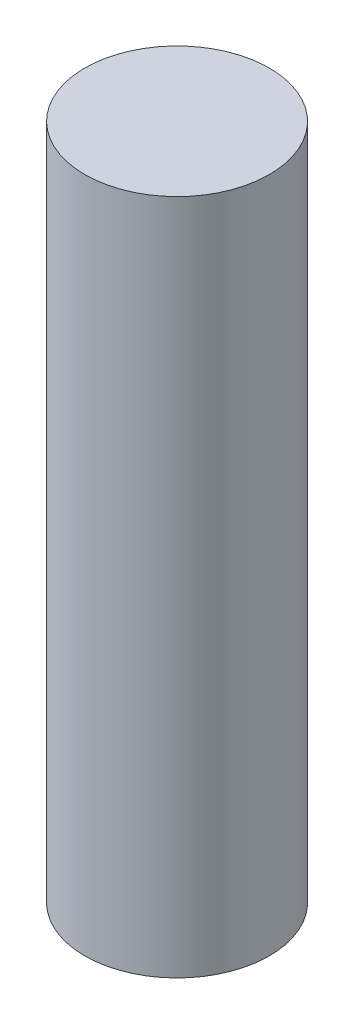
ISO-10303-21;
HEADER;
FILE_DESCRIPTION(('STEP AP214'),'2;1');
FILE_NAME('part.step','',(''),(''),'','','');
FILE_SCHEMA(('AUTOMOTIVE_DESIGN { 1 0 10303 214 1 1 1 1 }'));
ENDSEC;
DATA;
#1=APPLICATION_CONTEXT('core data for automotive mechanical design processes');
#2=APPLICATION_PROTOCOL_DEFINITION('international standard','automotive_design',2000,#1);
#3=PRODUCT_CONTEXT('',#1,'mechanical');
#4=PRODUCT('Part','Part','',(#3));
#5=PRODUCT_RELATED_PRODUCT_CATEGORY('part','',(#4));
#6=PRODUCT_DEFINITION_FORMATION('','',#4);
#7=PRODUCT_DEFINITION_CONTEXT('part definition',#1,'design');
#8=PRODUCT_DEFINITION('design','',#6,#7);
#9=PRODUCT_DEFINITION_SHAPE('','',#8);
#10=(LENGTH_UNIT() NAMED_UNIT(*) SI_UNIT(.MILLI.,.METRE.));
#11=(NAMED_UNIT(*) PLANE_ANGLE_UNIT() SI_UNIT($,.RADIAN.));
#12=(NAMED_UNIT(*) SI_UNIT($,.STERADIAN.) SOLID_ANGLE_UNIT());
#13=UNCERTAINTY_MEASURE_WITH_UNIT(LENGTH_MEASURE(1.E-05),#10,'distance_accuracy_value','');
#14=(GEOMETRIC_REPRESENTATION_CONTEXT(3) GLOBAL_UNCERTAINTY_ASSIGNED_CONTEXT((#13)) GLOBAL_UNIT_ASSIGNED_CONTEXT((#10,
#11,#12)) REPRESENTATION_CONTEXT('',''));
#15=CARTESIAN_POINT('',(0.,0.,0.));
#16=DIRECTION('',(0.,0.,1.));
#17=DIRECTION('',(1.,0.,0.));
#18=AXIS2_PLACEMENT_3D('',#15,#16,#17);
#19=CARTESIAN_POINT('',(0.,11.,0.));
#20=DIRECTION('',(0.,-1.,0.));
#21=DIRECTION('',(0.,0.,-1.));
#22=AXIS2_PLACEMENT_3D('',#19,#20,#21);
#23=CYLINDRICAL_SURFACE('',#22,1.5);
#24=CARTESIAN_POINT('',(0.,11.,0.));
#25=DIRECTION('',(0.,1.,0.));
#26=DIRECTION('',(0.,0.,1.));
#27=AXIS2_PLACEMENT_3D('',#24,#25,#26);
#28=CIRCLE('',#27,1.5);
#29=CARTESIAN_POINT('',(0.,11.,1.5));
#30=VERTEX_POINT('',#29);
#31=EDGE_CURVE('E10',#30,#30,#28,.T.);
#32=ORIENTED_EDGE('',*,*,#31,.F.);
#33=EDGE_LOOP('',(#32));
#34=FACE_BOUND('',#33,.T.);
#35=CARTESIAN_POINT('',(0.,0.,0.));
#36=DIRECTION('',(0.,1.,0.));
#37=DIRECTION('',(0.,0.,1.));
#38=AXIS2_PLACEMENT_3D('',#35,#36,#37);
#39=CIRCLE('',#38,1.5);
#40=CARTESIAN_POINT('',(0.,0.,1.5));
#41=VERTEX_POINT('',#40);
#42=EDGE_CURVE('E32',#41,#41,#39,.T.);
#43=ORIENTED_EDGE('',*,*,#42,.T.);
#44=EDGE_LOOP('',(#43));
#45=FACE_BOUND('',#44,.T.);
#46=ADVANCED_FACE('F29',(#34,#45),#23,.T.);
#47=CARTESIAN_POINT('',(0.,11.,0.));
#48=DIRECTION('',(0.,1.,0.));
#49=DIRECTION('',(0.,0.,1.));
#50=AXIS2_PLACEMENT_3D('',#47,#48,#49);
#51=PLANE('',#50);
#52=ORIENTED_EDGE('',*,*,#31,.T.);
#53=EDGE_LOOP('',(#52));
#54=FACE_BOUND('',#53,.T.);
#55=ADVANCED_FACE('F44',(#54),#51,.T.);
#56=CARTESIAN_POINT('',(0.,0.,0.));
#57=DIRECTION('',(0.,1.,0.));
#58=DIRECTION('',(0.,0.,1.));
#59=AXIS2_PLACEMENT_3D('',#56,#57,#58);
#60=PLANE('',#59);
#61=ORIENTED_EDGE('',*,*,#42,.F.);
#62=EDGE_LOOP('',(#61));
#63=FACE_BOUND('',#62,.T.);
#64=ADVANCED_FACE('F42',(#63),#60,.F.);
#65=CLOSED_SHELL('',(#46,#55,#64));
#66=MANIFOLD_SOLID_BREP('B2',#65);
#67=ADVANCED_BREP_SHAPE_REPRESENTATION('',(#18,#66),#14);
#68=SHAPE_DEFINITION_REPRESENTATION(#9,#67);
ENDSEC;
END-ISO-10303-21;
